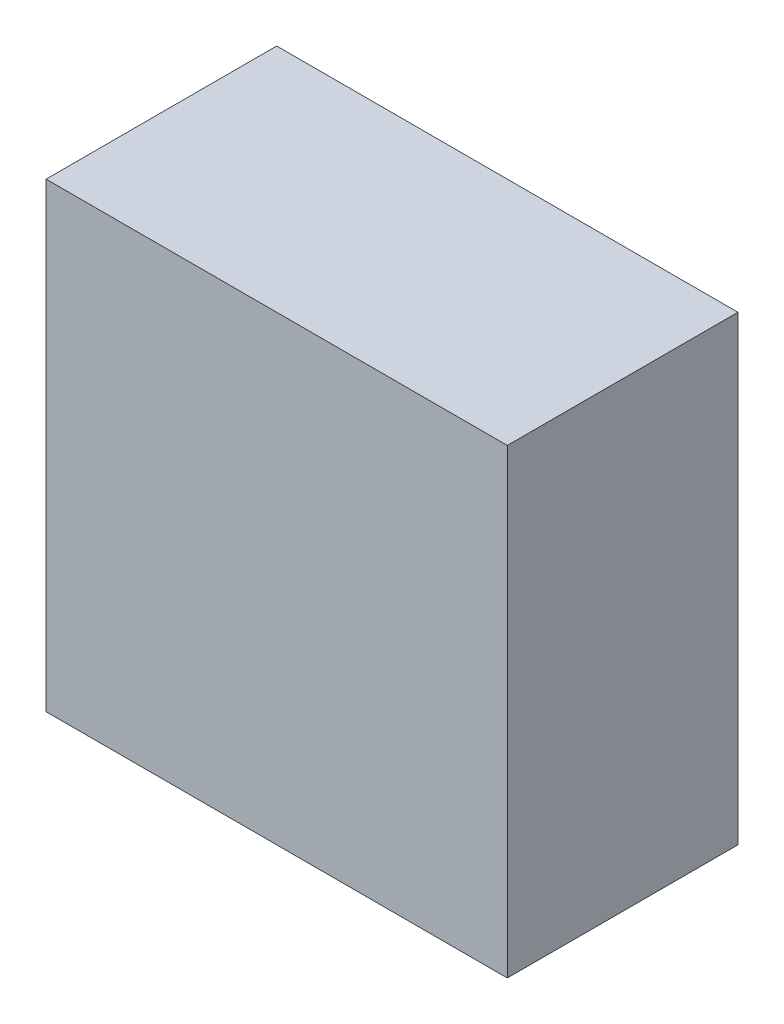
ISO-10303-21;
HEADER;
FILE_DESCRIPTION(('STEP AP214'),'2;1');
FILE_NAME('part.step','',(''),(''),'','','');
FILE_SCHEMA(('AUTOMOTIVE_DESIGN { 1 0 10303 214 1 1 1 1 }'));
ENDSEC;
DATA;
#1=APPLICATION_CONTEXT('core data for automotive mechanical design processes');
#2=APPLICATION_PROTOCOL_DEFINITION('international standard','automotive_design',2000,#1);
#3=PRODUCT_CONTEXT('',#1,'mechanical');
#4=PRODUCT('Part','Part','',(#3));
#5=PRODUCT_RELATED_PRODUCT_CATEGORY('part','',(#4));
#6=PRODUCT_DEFINITION_FORMATION('','',#4);
#7=PRODUCT_DEFINITION_CONTEXT('part definition',#1,'design');
#8=PRODUCT_DEFINITION('design','',#6,#7);
#9=PRODUCT_DEFINITION_SHAPE('','',#8);
#10=(LENGTH_UNIT() NAMED_UNIT(*) SI_UNIT(.MILLI.,.METRE.));
#11=(NAMED_UNIT(*) PLANE_ANGLE_UNIT() SI_UNIT($,.RADIAN.));
#12=(NAMED_UNIT(*) SI_UNIT($,.STERADIAN.) SOLID_ANGLE_UNIT());
#13=UNCERTAINTY_MEASURE_WITH_UNIT(LENGTH_MEASURE(1.E-05),#10,'distance_accuracy_value','');
#14=(GEOMETRIC_REPRESENTATION_CONTEXT(3) GLOBAL_UNCERTAINTY_ASSIGNED_CONTEXT((#13)) GLOBAL_UNIT_ASSIGNED_CONTEXT((#10,
#11,#12)) REPRESENTATION_CONTEXT('',''));
#15=CARTESIAN_POINT('',(0.,0.,0.));
#16=DIRECTION('',(0.,0.,1.));
#17=DIRECTION('',(1.,0.,0.));
#18=AXIS2_PLACEMENT_3D('',#15,#16,#17);
#19=CARTESIAN_POINT('',(0.,0.,2.75));
#20=DIRECTION('',(0.,0.,-1.));
#21=DIRECTION('',(-1.,0.,0.));
#22=AXIS2_PLACEMENT_3D('',#19,#20,#21);
#23=PLANE('',#22);
#24=DIRECTION('',(1.,0.,0.));
#25=VECTOR('',#24,1.);
#26=CARTESIAN_POINT('',(158.313158045853,32.9291158443043,2.75));
#27=LINE('',#26,#25);
#28=CARTESIAN_POINT('',(158.313158045853,32.9291158443043,2.75));
#29=VERTEX_POINT('',#28);
#30=CARTESIAN_POINT('',(154.313158045853,32.9291158443043,2.75));
#31=VERTEX_POINT('',#30);
#32=EDGE_CURVE('E80',#29,#31,#27,.F.);
#33=ORIENTED_EDGE('',*,*,#32,.T.);
#34=DIRECTION('',(0.,1.,0.));
#35=VECTOR('',#34,1.);
#36=CARTESIAN_POINT('',(154.313158045853,32.9291158443043,2.75));
#37=LINE('',#36,#35);
#38=CARTESIAN_POINT('',(154.313158045853,28.9291158443043,2.75));
#39=VERTEX_POINT('',#38);
#40=EDGE_CURVE('E55',#31,#39,#37,.F.);
#41=ORIENTED_EDGE('',*,*,#40,.T.);
#42=DIRECTION('',(1.,0.,0.));
#43=VECTOR('',#42,1.);
#44=CARTESIAN_POINT('',(158.313158045853,28.9291158443043,2.75));
#45=LINE('',#44,#43);
#46=CARTESIAN_POINT('',(158.313158045853,28.9291158443043,2.75));
#47=VERTEX_POINT('',#46);
#48=EDGE_CURVE('E57',#39,#47,#45,.T.);
#49=ORIENTED_EDGE('',*,*,#48,.T.);
#50=DIRECTION('',(0.,1.,0.));
#51=VECTOR('',#50,1.);
#52=CARTESIAN_POINT('',(158.313158045853,32.9291158443043,2.75));
#53=LINE('',#52,#51);
#54=EDGE_CURVE('E20',#47,#29,#53,.T.);
#55=ORIENTED_EDGE('',*,*,#54,.T.);
#56=EDGE_LOOP('',(#33,#41,#49,#55));
#57=FACE_BOUND('',#56,.T.);
#58=ADVANCED_FACE('F17',(#57),#23,.F.);
#59=CARTESIAN_POINT('',(158.313158045853,32.9291158443043,2.75));
#60=DIRECTION('',(-1.,0.,0.));
#61=DIRECTION('',(0.,0.,1.));
#62=AXIS2_PLACEMENT_3D('',#59,#60,#61);
#63=PLANE('',#62);
#64=DIRECTION('',(0.,0.,-1.));
#65=VECTOR('',#64,1.);
#66=CARTESIAN_POINT('',(158.313158045853,32.9291158443043,2.75));
#67=LINE('',#66,#65);
#68=CARTESIAN_POINT('',(158.313158045853,32.9291158443043,0.75));
#69=VERTEX_POINT('',#68);
#70=EDGE_CURVE('E68',#69,#29,#67,.F.);
#71=ORIENTED_EDGE('',*,*,#70,.T.);
#72=ORIENTED_EDGE('',*,*,#54,.F.);
#73=DIRECTION('',(0.,0.,1.));
#74=VECTOR('',#73,1.);
#75=CARTESIAN_POINT('',(158.313158045853,28.9291158443043,2.75));
#76=LINE('',#75,#74);
#77=CARTESIAN_POINT('',(158.313158045853,28.9291158443043,0.75));
#78=VERTEX_POINT('',#77);
#79=EDGE_CURVE('E63',#47,#78,#76,.F.);
#80=ORIENTED_EDGE('',*,*,#79,.T.);
#81=DIRECTION('',(0.,1.,0.));
#82=VECTOR('',#81,1.);
#83=CARTESIAN_POINT('',(158.313158045853,0.,0.75));
#84=LINE('',#83,#82);
#85=EDGE_CURVE('E83',#69,#78,#84,.F.);
#86=ORIENTED_EDGE('',*,*,#85,.F.);
#87=EDGE_LOOP('',(#71,#72,#80,#86));
#88=FACE_BOUND('',#87,.T.);
#89=ADVANCED_FACE('F65',(#88),#63,.F.);
#90=CARTESIAN_POINT('',(158.313158045853,28.9291158443043,2.75));
#91=DIRECTION('',(0.,1.,0.));
#92=DIRECTION('',(0.,0.,1.));
#93=AXIS2_PLACEMENT_3D('',#90,#91,#92);
#94=PLANE('',#93);
#95=ORIENTED_EDGE('',*,*,#79,.F.);
#96=ORIENTED_EDGE('',*,*,#48,.F.);
#97=DIRECTION('',(0.,0.,-1.));
#98=VECTOR('',#97,1.);
#99=CARTESIAN_POINT('',(154.313158045853,28.9291158443043,2.75));
#100=LINE('',#99,#98);
#101=CARTESIAN_POINT('',(154.313158045853,28.9291158443043,0.75));
#102=VERTEX_POINT('',#101);
#103=EDGE_CURVE('E75',#39,#102,#100,.T.);
#104=ORIENTED_EDGE('',*,*,#103,.T.);
#105=DIRECTION('',(-1.,0.,0.));
#106=VECTOR('',#105,1.);
#107=CARTESIAN_POINT('',(0.,28.9291158443043,0.75));
#108=LINE('',#107,#106);
#109=EDGE_CURVE('E72',#78,#102,#108,.T.);
#110=ORIENTED_EDGE('',*,*,#109,.F.);
#111=EDGE_LOOP('',(#95,#96,#104,#110));
#112=FACE_BOUND('',#111,.T.);
#113=ADVANCED_FACE('F70',(#112),#94,.F.);
#114=CARTESIAN_POINT('',(154.313158045853,32.9291158443043,2.75));
#115=DIRECTION('',(1.,0.,0.));
#116=DIRECTION('',(0.,0.,-1.));
#117=AXIS2_PLACEMENT_3D('',#114,#115,#116);
#118=PLANE('',#117);
#119=ORIENTED_EDGE('',*,*,#103,.F.);
#120=ORIENTED_EDGE('',*,*,#40,.F.);
#121=DIRECTION('',(0.,0.,-1.));
#122=VECTOR('',#121,1.);
#123=CARTESIAN_POINT('',(154.313158045853,32.9291158443043,2.75));
#124=LINE('',#123,#122);
#125=CARTESIAN_POINT('',(154.313158045853,32.9291158443043,0.75));
#126=VERTEX_POINT('',#125);
#127=EDGE_CURVE('E35',#31,#126,#124,.T.);
#128=ORIENTED_EDGE('',*,*,#127,.T.);
#129=DIRECTION('',(0.,1.,0.));
#130=VECTOR('',#129,1.);
#131=CARTESIAN_POINT('',(154.313158045853,0.,0.75));
#132=LINE('',#131,#130);
#133=EDGE_CURVE('E26',#102,#126,#132,.T.);
#134=ORIENTED_EDGE('',*,*,#133,.F.);
#135=EDGE_LOOP('',(#119,#120,#128,#134));
#136=FACE_BOUND('',#135,.T.);
#137=ADVANCED_FACE('F89',(#136),#118,.F.);
#138=CARTESIAN_POINT('',(158.313158045853,32.9291158443043,2.75));
#139=DIRECTION('',(0.,-1.,0.));
#140=DIRECTION('',(0.,0.,-1.));
#141=AXIS2_PLACEMENT_3D('',#138,#139,#140);
#142=PLANE('',#141);
#143=ORIENTED_EDGE('',*,*,#127,.F.);
#144=ORIENTED_EDGE('',*,*,#32,.F.);
#145=ORIENTED_EDGE('',*,*,#70,.F.);
#146=DIRECTION('',(-1.,0.,0.));
#147=VECTOR('',#146,1.);
#148=CARTESIAN_POINT('',(0.,32.9291158443043,0.75));
#149=LINE('',#148,#147);
#150=EDGE_CURVE('E11',#126,#69,#149,.F.);
#151=ORIENTED_EDGE('',*,*,#150,.F.);
#152=EDGE_LOOP('',(#143,#144,#145,#151));
#153=FACE_BOUND('',#152,.T.);
#154=ADVANCED_FACE('F91',(#153),#142,.F.);
#155=CARTESIAN_POINT('',(0.,0.,0.75));
#156=DIRECTION('',(0.,0.,-1.));
#157=DIRECTION('',(-1.,0.,0.));
#158=AXIS2_PLACEMENT_3D('',#155,#156,#157);
#159=PLANE('',#158);
#160=ORIENTED_EDGE('',*,*,#133,.T.);
#161=ORIENTED_EDGE('',*,*,#150,.T.);
#162=ORIENTED_EDGE('',*,*,#85,.T.);
#163=ORIENTED_EDGE('',*,*,#109,.T.);
#164=EDGE_LOOP('',(#160,#161,#162,#163));
#165=FACE_BOUND('',#164,.T.);
#166=ADVANCED_FACE('F88',(#165),#159,.T.);
#167=CLOSED_SHELL('',(#58,#89,#113,#137,#154,#166));
#168=MANIFOLD_SOLID_BREP('B1',#167);
#169=ADVANCED_BREP_SHAPE_REPRESENTATION('',(#18,#168),#14);
#170=SHAPE_DEFINITION_REPRESENTATION(#9,#169);
ENDSEC;
END-ISO-10303-21;
